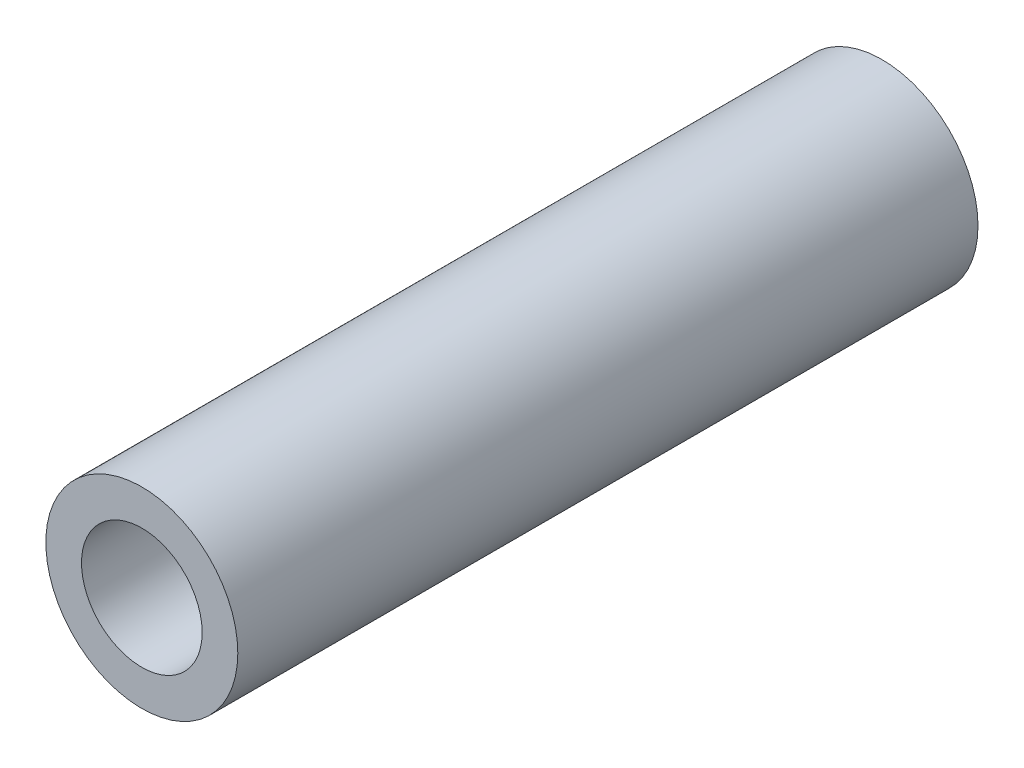
ISO-10303-21;
HEADER;
FILE_DESCRIPTION(('STEP AP214'),'2;1');
FILE_NAME('part.step','',(''),(''),'','','');
FILE_SCHEMA(('AUTOMOTIVE_DESIGN { 1 0 10303 214 1 1 1 1 }'));
ENDSEC;
DATA;
#1=APPLICATION_CONTEXT('core data for automotive mechanical design processes');
#2=APPLICATION_PROTOCOL_DEFINITION('international standard','automotive_design',2000,#1);
#3=PRODUCT_CONTEXT('',#1,'mechanical');
#4=PRODUCT('Part','Part','',(#3));
#5=PRODUCT_RELATED_PRODUCT_CATEGORY('part','',(#4));
#6=PRODUCT_DEFINITION_FORMATION('','',#4);
#7=PRODUCT_DEFINITION_CONTEXT('part definition',#1,'design');
#8=PRODUCT_DEFINITION('design','',#6,#7);
#9=PRODUCT_DEFINITION_SHAPE('','',#8);
#10=(LENGTH_UNIT() NAMED_UNIT(*) SI_UNIT(.MILLI.,.METRE.));
#11=(NAMED_UNIT(*) PLANE_ANGLE_UNIT() SI_UNIT($,.RADIAN.));
#12=(NAMED_UNIT(*) SI_UNIT($,.STERADIAN.) SOLID_ANGLE_UNIT());
#13=UNCERTAINTY_MEASURE_WITH_UNIT(LENGTH_MEASURE(1.E-05),#10,'distance_accuracy_value','');
#14=(GEOMETRIC_REPRESENTATION_CONTEXT(3) GLOBAL_UNCERTAINTY_ASSIGNED_CONTEXT((#13)) GLOBAL_UNIT_ASSIGNED_CONTEXT((#10,
#11,#12)) REPRESENTATION_CONTEXT('',''));
#15=CARTESIAN_POINT('',(0.,0.,0.));
#16=DIRECTION('',(0.,0.,1.));
#17=DIRECTION('',(1.,0.,0.));
#18=AXIS2_PLACEMENT_3D('',#15,#16,#17);
#19=CARTESIAN_POINT('',(0.,7.,26.9900146127512));
#20=DIRECTION('',(0.,0.,-1.));
#21=DIRECTION('',(-1.,0.,0.));
#22=AXIS2_PLACEMENT_3D('',#19,#20,#21);
#23=PLANE('',#22);
#24=CARTESIAN_POINT('',(0.,0.,26.9900146127512));
#25=DIRECTION('',(0.,0.,1.));
#26=DIRECTION('',(1.,0.,0.));
#27=AXIS2_PLACEMENT_3D('',#24,#25,#26);
#28=CIRCLE('',#27,7.);
#29=CARTESIAN_POINT('',(7.,0.,26.9900146127512));
#30=VERTEX_POINT('',#29);
#31=EDGE_CURVE('E10',#30,#30,#28,.T.);
#32=ORIENTED_EDGE('',*,*,#31,.T.);
#33=EDGE_LOOP('',(#32));
#34=FACE_BOUND('',#33,.T.);
#35=CARTESIAN_POINT('',(0.,0.,26.9900146127512));
#36=DIRECTION('',(0.,0.,1.));
#37=DIRECTION('',(1.,0.,0.));
#38=AXIS2_PLACEMENT_3D('',#35,#36,#37);
#39=CIRCLE('',#38,4.4);
#40=CARTESIAN_POINT('',(4.4,0.,26.9900146127512));
#41=VERTEX_POINT('',#40);
#42=EDGE_CURVE('E53',#41,#41,#39,.T.);
#43=ORIENTED_EDGE('',*,*,#42,.F.);
#44=EDGE_LOOP('',(#43));
#45=FACE_BOUND('',#44,.T.);
#46=ADVANCED_FACE('F38',(#34,#45),#23,.F.);
#47=CARTESIAN_POINT('',(0.,0.,1000.));
#48=DIRECTION('',(0.,0.,1.));
#49=DIRECTION('',(1.,0.,0.));
#50=AXIS2_PLACEMENT_3D('',#47,#48,#49);
#51=CYLINDRICAL_SURFACE('',#50,7.);
#52=ORIENTED_EDGE('',*,*,#31,.F.);
#53=EDGE_LOOP('',(#52));
#54=FACE_BOUND('',#53,.T.);
#55=CARTESIAN_POINT('',(0.,0.,-26.9900146127512));
#56=DIRECTION('',(0.,0.,1.));
#57=DIRECTION('',(1.,0.,0.));
#58=AXIS2_PLACEMENT_3D('',#55,#56,#57);
#59=CIRCLE('',#58,7.);
#60=CARTESIAN_POINT('',(7.,0.,-26.9900146127512));
#61=VERTEX_POINT('',#60);
#62=EDGE_CURVE('E56',#61,#61,#59,.T.);
#63=ORIENTED_EDGE('',*,*,#62,.T.);
#64=EDGE_LOOP('',(#63));
#65=FACE_BOUND('',#64,.T.);
#66=ADVANCED_FACE('F40',(#54,#65),#51,.T.);
#67=CARTESIAN_POINT('',(0.,0.,0.740014612751191));
#68=DIRECTION('',(0.,0.,1.));
#69=DIRECTION('',(1.,0.,0.));
#70=AXIS2_PLACEMENT_3D('',#67,#68,#69);
#71=CONICAL_SURFACE('',#70,4.4,1.02974425867665);
#72=CARTESIAN_POINT('',(0.,0.,0.740014612751191));
#73=DIRECTION('',(0.,0.,1.));
#74=DIRECTION('',(1.,0.,0.));
#75=AXIS2_PLACEMENT_3D('',#72,#73,#74);
#76=CIRCLE('',#75,4.4);
#77=CARTESIAN_POINT('',(4.4,0.,0.740014612751191));
#78=VERTEX_POINT('',#77);
#79=EDGE_CURVE('E49',#78,#78,#76,.T.);
#80=ORIENTED_EDGE('',*,*,#79,.T.);
#81=EDGE_LOOP('',(#80));
#82=FACE_BOUND('',#81,.T.);
#83=CARTESIAN_POINT('',(0.,0.,0.));
#84=DIRECTION('',(0.,0.,1.));
#85=DIRECTION('',(1.,0.,0.));
#86=AXIS2_PLACEMENT_3D('',#83,#84,#85);
#87=CIRCLE('',#86,3.16840886335863);
#88=CARTESIAN_POINT('',(3.16840886335863,0.,0.));
#89=VERTEX_POINT('',#88);
#90=EDGE_CURVE('E42',#89,#89,#87,.T.);
#91=ORIENTED_EDGE('',*,*,#90,.F.);
#92=EDGE_LOOP('',(#91));
#93=FACE_BOUND('',#92,.T.);
#94=ADVANCED_FACE('F82',(#82,#93),#71,.F.);
#95=CARTESIAN_POINT('',(0.,0.,26.9900146127512));
#96=DIRECTION('',(0.,0.,1.));
#97=DIRECTION('',(1.,0.,0.));
#98=AXIS2_PLACEMENT_3D('',#95,#96,#97);
#99=CYLINDRICAL_SURFACE('',#98,4.4);
#100=ORIENTED_EDGE('',*,*,#79,.F.);
#101=EDGE_LOOP('',(#100));
#102=FACE_BOUND('',#101,.T.);
#103=ORIENTED_EDGE('',*,*,#42,.T.);
#104=EDGE_LOOP('',(#103));
#105=FACE_BOUND('',#104,.T.);
#106=ADVANCED_FACE('F88',(#102,#105),#99,.F.);
#107=CARTESIAN_POINT('',(0.,7.,-26.9900146127512));
#108=DIRECTION('',(0.,0.,1.));
#109=DIRECTION('',(-1.,0.,0.));
#110=AXIS2_PLACEMENT_3D('',#107,#108,#109);
#111=PLANE('',#110);
#112=ORIENTED_EDGE('',*,*,#62,.F.);
#113=EDGE_LOOP('',(#112));
#114=FACE_BOUND('',#113,.T.);
#115=CARTESIAN_POINT('',(0.,0.,-26.9900146127512));
#116=DIRECTION('',(0.,0.,1.));
#117=DIRECTION('',(1.,0.,0.));
#118=AXIS2_PLACEMENT_3D('',#115,#116,#117);
#119=CIRCLE('',#118,4.4);
#120=CARTESIAN_POINT('',(4.4,0.,-26.9900146127512));
#121=VERTEX_POINT('',#120);
#122=EDGE_CURVE('E62',#121,#121,#119,.T.);
#123=ORIENTED_EDGE('',*,*,#122,.T.);
#124=EDGE_LOOP('',(#123));
#125=FACE_BOUND('',#124,.T.);
#126=ADVANCED_FACE('F66',(#114,#125),#111,.F.);
#127=CARTESIAN_POINT('',(0.,0.,-0.740014612751191));
#128=DIRECTION('',(0.,0.,-1.));
#129=DIRECTION('',(1.,0.,0.));
#130=AXIS2_PLACEMENT_3D('',#127,#128,#129);
#131=CONICAL_SURFACE('',#130,4.4,1.02974425867665);
#132=CARTESIAN_POINT('',(0.,0.,-0.740014612751191));
#133=DIRECTION('',(0.,0.,1.));
#134=DIRECTION('',(1.,0.,0.));
#135=AXIS2_PLACEMENT_3D('',#132,#133,#134);
#136=CIRCLE('',#135,4.4);
#137=CARTESIAN_POINT('',(4.4,0.,-0.740014612751191));
#138=VERTEX_POINT('',#137);
#139=EDGE_CURVE('E59',#138,#138,#136,.T.);
#140=ORIENTED_EDGE('',*,*,#139,.F.);
#141=EDGE_LOOP('',(#140));
#142=FACE_BOUND('',#141,.T.);
#143=ORIENTED_EDGE('',*,*,#90,.T.);
#144=EDGE_LOOP('',(#143));
#145=FACE_BOUND('',#144,.T.);
#146=ADVANCED_FACE('F70',(#142,#145),#131,.F.);
#147=CARTESIAN_POINT('',(0.,0.,-26.9900146127512));
#148=DIRECTION('',(0.,0.,-1.));
#149=DIRECTION('',(1.,0.,0.));
#150=AXIS2_PLACEMENT_3D('',#147,#148,#149);
#151=CYLINDRICAL_SURFACE('',#150,4.4);
#152=ORIENTED_EDGE('',*,*,#139,.T.);
#153=EDGE_LOOP('',(#152));
#154=FACE_BOUND('',#153,.T.);
#155=ORIENTED_EDGE('',*,*,#122,.F.);
#156=EDGE_LOOP('',(#155));
#157=FACE_BOUND('',#156,.T.);
#158=ADVANCED_FACE('F68',(#154,#157),#151,.F.);
#159=CLOSED_SHELL('',(#46,#66,#94,#106,#126,#146,#158));
#160=MANIFOLD_SOLID_BREP('B2',#159);
#161=ADVANCED_BREP_SHAPE_REPRESENTATION('',(#18,#160),#14);
#162=SHAPE_DEFINITION_REPRESENTATION(#9,#161);
ENDSEC;
END-ISO-10303-21;
